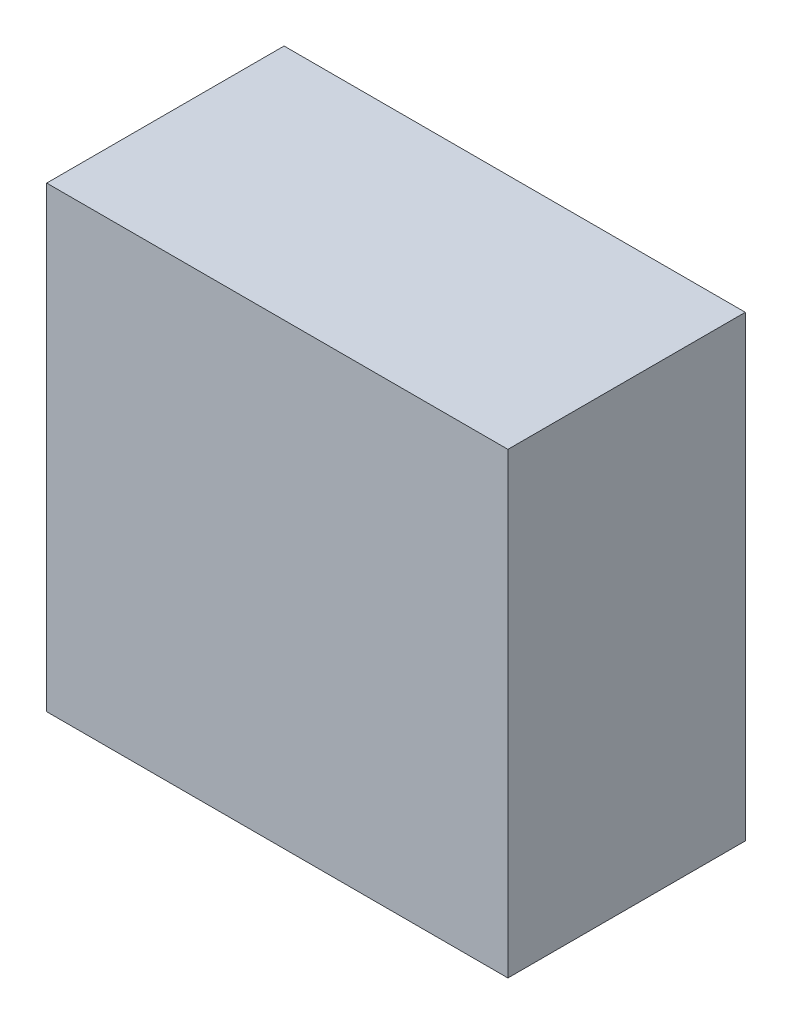
ISO-10303-21;
HEADER;
FILE_DESCRIPTION(('STEP AP214'),'2;1');
FILE_NAME('part.step','',(''),(''),'','','');
FILE_SCHEMA(('AUTOMOTIVE_DESIGN { 1 0 10303 214 1 1 1 1 }'));
ENDSEC;
DATA;
#1=APPLICATION_CONTEXT('core data for automotive mechanical design processes');
#2=APPLICATION_PROTOCOL_DEFINITION('international standard','automotive_design',2000,#1);
#3=PRODUCT_CONTEXT('',#1,'mechanical');
#4=PRODUCT('Part','Part','',(#3));
#5=PRODUCT_RELATED_PRODUCT_CATEGORY('part','',(#4));
#6=PRODUCT_DEFINITION_FORMATION('','',#4);
#7=PRODUCT_DEFINITION_CONTEXT('part definition',#1,'design');
#8=PRODUCT_DEFINITION('design','',#6,#7);
#9=PRODUCT_DEFINITION_SHAPE('','',#8);
#10=(LENGTH_UNIT() NAMED_UNIT(*) SI_UNIT(.MILLI.,.METRE.));
#11=(NAMED_UNIT(*) PLANE_ANGLE_UNIT() SI_UNIT($,.RADIAN.));
#12=(NAMED_UNIT(*) SI_UNIT($,.STERADIAN.) SOLID_ANGLE_UNIT());
#13=UNCERTAINTY_MEASURE_WITH_UNIT(LENGTH_MEASURE(1.E-05),#10,'distance_accuracy_value','');
#14=(GEOMETRIC_REPRESENTATION_CONTEXT(3) GLOBAL_UNCERTAINTY_ASSIGNED_CONTEXT((#13)) GLOBAL_UNIT_ASSIGNED_CONTEXT((#10,
#11,#12)) REPRESENTATION_CONTEXT('',''));
#15=CARTESIAN_POINT('',(0.,0.,0.));
#16=DIRECTION('',(0.,0.,1.));
#17=DIRECTION('',(1.,0.,0.));
#18=AXIS2_PLACEMENT_3D('',#15,#16,#17);
#19=CARTESIAN_POINT('',(0.68000118,0.67499992,0.));
#20=DIRECTION('',(0.99999999999823,1.88148170224543E-06,0.));
#21=DIRECTION('',(1.88148170224543E-06,-0.99999999999823,0.));
#22=AXIS2_PLACEMENT_3D('',#19,#20,#21);
#23=PLANE('',#22);
#24=DIRECTION('',(0.,0.,1.));
#25=VECTOR('',#24,1.);
#26=CARTESIAN_POINT('',(0.68000118,0.67499992,0.));
#27=LINE('',#26,#25);
#28=CARTESIAN_POINT('',(0.68000118,0.67499992,0.));
#29=VERTEX_POINT('',#28);
#30=CARTESIAN_POINT('',(0.68000118,0.67499992,0.70000114));
#31=VERTEX_POINT('',#30);
#32=EDGE_CURVE('E11',#29,#31,#27,.T.);
#33=ORIENTED_EDGE('',*,*,#32,.T.);
#34=DIRECTION('',(1.88148170224543E-06,-0.99999999999823,0.));
#35=VECTOR('',#34,1.);
#36=CARTESIAN_POINT('',(0.68000118,0.67499992,0.70000114));
#37=LINE('',#36,#35);
#38=CARTESIAN_POINT('',(0.68000372,-0.67499992,0.70000114));
#39=VERTEX_POINT('',#38);
#40=EDGE_CURVE('E24',#31,#39,#37,.T.);
#41=ORIENTED_EDGE('',*,*,#40,.T.);
#42=DIRECTION('',(0.,0.,1.));
#43=VECTOR('',#42,1.);
#44=CARTESIAN_POINT('',(0.68000372,-0.67499992,0.));
#45=LINE('',#44,#43);
#46=CARTESIAN_POINT('',(0.68000372,-0.67499992,0.));
#47=VERTEX_POINT('',#46);
#48=EDGE_CURVE('E85',#47,#39,#45,.T.);
#49=ORIENTED_EDGE('',*,*,#48,.F.);
#50=DIRECTION('',(1.88148170224543E-06,-0.99999999999823,0.));
#51=VECTOR('',#50,1.);
#52=CARTESIAN_POINT('',(0.68000118,0.67499992,0.));
#53=LINE('',#52,#51);
#54=EDGE_CURVE('E83',#29,#47,#53,.T.);
#55=ORIENTED_EDGE('',*,*,#54,.F.);
#56=EDGE_LOOP('',(#33,#41,#49,#55));
#57=FACE_BOUND('',#56,.T.);
#58=ADVANCED_FACE('F17',(#57),#23,.T.);
#59=CARTESIAN_POINT('',(0.68000372,-0.67499992,0.));
#60=DIRECTION('',(0.,-1.,0.));
#61=DIRECTION('',(-1.,0.,0.));
#62=AXIS2_PLACEMENT_3D('',#59,#60,#61);
#63=PLANE('',#62);
#64=ORIENTED_EDGE('',*,*,#48,.T.);
#65=DIRECTION('',(-1.,0.,0.));
#66=VECTOR('',#65,1.);
#67=CARTESIAN_POINT('',(0.68000372,-0.67499992,0.70000114));
#68=LINE('',#67,#66);
#69=CARTESIAN_POINT('',(-0.67999864,-0.67499992,0.70000114));
#70=VERTEX_POINT('',#69);
#71=EDGE_CURVE('E81',#39,#70,#68,.T.);
#72=ORIENTED_EDGE('',*,*,#71,.T.);
#73=DIRECTION('',(0.,0.,1.));
#74=VECTOR('',#73,1.);
#75=CARTESIAN_POINT('',(-0.67999864,-0.67499992,0.));
#76=LINE('',#75,#74);
#77=CARTESIAN_POINT('',(-0.67999864,-0.67499992,0.));
#78=VERTEX_POINT('',#77);
#79=EDGE_CURVE('E79',#78,#70,#76,.T.);
#80=ORIENTED_EDGE('',*,*,#79,.F.);
#81=DIRECTION('',(-1.,0.,0.));
#82=VECTOR('',#81,1.);
#83=CARTESIAN_POINT('',(0.68000372,-0.67499992,0.));
#84=LINE('',#83,#82);
#85=EDGE_CURVE('E70',#47,#78,#84,.T.);
#86=ORIENTED_EDGE('',*,*,#85,.F.);
#87=EDGE_LOOP('',(#64,#72,#80,#86));
#88=FACE_BOUND('',#87,.T.);
#89=ADVANCED_FACE('F90',(#88),#63,.T.);
#90=CARTESIAN_POINT('',(-0.67999864,-0.67499992,0.));
#91=DIRECTION('',(-0.99999999999823,-1.88148170224543E-06,0.));
#92=DIRECTION('',(-1.88148170224543E-06,0.99999999999823,0.));
#93=AXIS2_PLACEMENT_3D('',#90,#91,#92);
#94=PLANE('',#93);
#95=ORIENTED_EDGE('',*,*,#79,.T.);
#96=DIRECTION('',(-1.88148170224543E-06,0.99999999999823,0.));
#97=VECTOR('',#96,1.);
#98=CARTESIAN_POINT('',(-0.67999864,-0.67499992,0.70000114));
#99=LINE('',#98,#97);
#100=CARTESIAN_POINT('',(-0.68000118,0.67499992,0.70000114));
#101=VERTEX_POINT('',#100);
#102=EDGE_CURVE('E60',#70,#101,#99,.T.);
#103=ORIENTED_EDGE('',*,*,#102,.T.);
#104=DIRECTION('',(0.,0.,1.));
#105=VECTOR('',#104,1.);
#106=CARTESIAN_POINT('',(-0.68000118,0.67499992,0.));
#107=LINE('',#106,#105);
#108=CARTESIAN_POINT('',(-0.68000118,0.67499992,0.));
#109=VERTEX_POINT('',#108);
#110=EDGE_CURVE('E54',#109,#101,#107,.T.);
#111=ORIENTED_EDGE('',*,*,#110,.F.);
#112=DIRECTION('',(-1.88148170224543E-06,0.99999999999823,0.));
#113=VECTOR('',#112,1.);
#114=CARTESIAN_POINT('',(-0.67999864,-0.67499992,0.));
#115=LINE('',#114,#113);
#116=EDGE_CURVE('E58',#78,#109,#115,.T.);
#117=ORIENTED_EDGE('',*,*,#116,.F.);
#118=EDGE_LOOP('',(#95,#103,#111,#117));
#119=FACE_BOUND('',#118,.T.);
#120=ADVANCED_FACE('F57',(#119),#94,.T.);
#121=CARTESIAN_POINT('',(-0.68000118,0.67499992,0.));
#122=DIRECTION('',(0.,1.,0.));
#123=DIRECTION('',(1.,0.,0.));
#124=AXIS2_PLACEMENT_3D('',#121,#122,#123);
#125=PLANE('',#124);
#126=ORIENTED_EDGE('',*,*,#110,.T.);
#127=DIRECTION('',(1.,0.,0.));
#128=VECTOR('',#127,1.);
#129=CARTESIAN_POINT('',(-0.68000118,0.67499992,0.70000114));
#130=LINE('',#129,#128);
#131=EDGE_CURVE('E71',#101,#31,#130,.T.);
#132=ORIENTED_EDGE('',*,*,#131,.T.);
#133=ORIENTED_EDGE('',*,*,#32,.F.);
#134=DIRECTION('',(1.,0.,0.));
#135=VECTOR('',#134,1.);
#136=CARTESIAN_POINT('',(-0.68000118,0.67499992,0.));
#137=LINE('',#136,#135);
#138=EDGE_CURVE('E68',#109,#29,#137,.T.);
#139=ORIENTED_EDGE('',*,*,#138,.F.);
#140=EDGE_LOOP('',(#126,#132,#133,#139));
#141=FACE_BOUND('',#140,.T.);
#142=ADVANCED_FACE('F73',(#141),#125,.T.);
#143=CARTESIAN_POINT('',(0.68000118,0.67499992,0.));
#144=DIRECTION('',(0.,0.,1.));
#145=DIRECTION('',(1.,0.,0.));
#146=AXIS2_PLACEMENT_3D('',#143,#144,#145);
#147=PLANE('',#146);
#148=ORIENTED_EDGE('',*,*,#54,.T.);
#149=ORIENTED_EDGE('',*,*,#85,.T.);
#150=ORIENTED_EDGE('',*,*,#116,.T.);
#151=ORIENTED_EDGE('',*,*,#138,.T.);
#152=EDGE_LOOP('',(#148,#149,#150,#151));
#153=FACE_BOUND('',#152,.T.);
#154=ADVANCED_FACE('F67',(#153),#147,.F.);
#155=CARTESIAN_POINT('',(0.68000118,0.67499992,0.70000114));
#156=DIRECTION('',(0.,0.,1.));
#157=DIRECTION('',(1.,0.,0.));
#158=AXIS2_PLACEMENT_3D('',#155,#156,#157);
#159=PLANE('',#158);
#160=ORIENTED_EDGE('',*,*,#131,.F.);
#161=ORIENTED_EDGE('',*,*,#102,.F.);
#162=ORIENTED_EDGE('',*,*,#71,.F.);
#163=ORIENTED_EDGE('',*,*,#40,.F.);
#164=EDGE_LOOP('',(#160,#161,#162,#163));
#165=FACE_BOUND('',#164,.T.);
#166=ADVANCED_FACE('F91',(#165),#159,.T.);
#167=CLOSED_SHELL('',(#58,#89,#120,#142,#154,#166));
#168=MANIFOLD_SOLID_BREP('B1',#167);
#169=ADVANCED_BREP_SHAPE_REPRESENTATION('',(#18,#168),#14);
#170=SHAPE_DEFINITION_REPRESENTATION(#9,#169);
ENDSEC;
END-ISO-10303-21;
